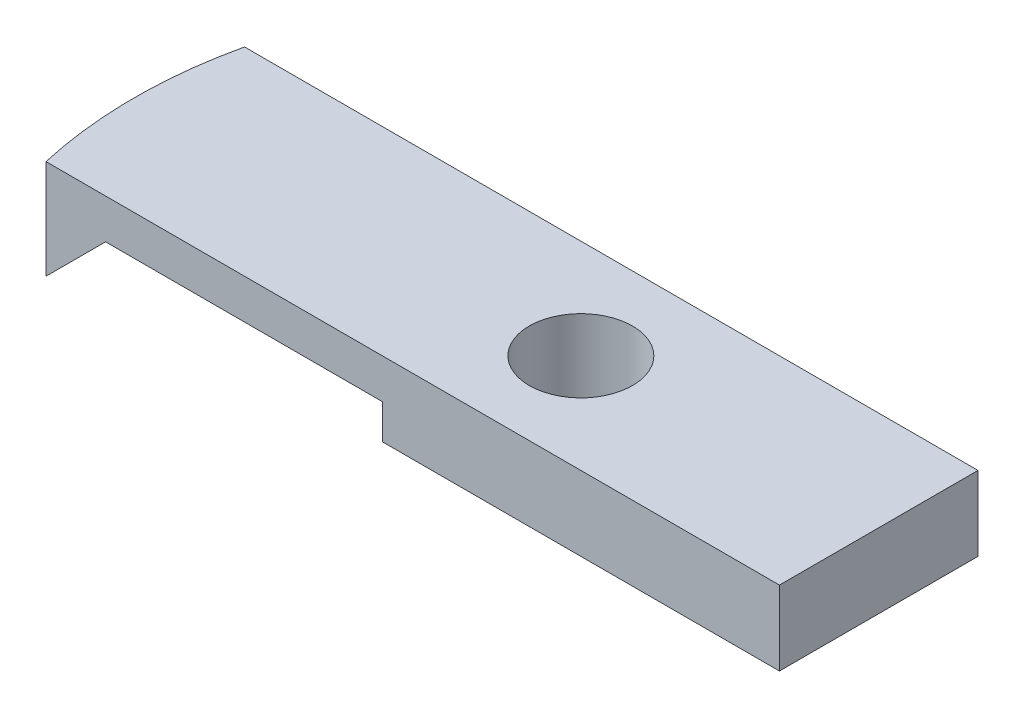
ISO-10303-21;
HEADER;
FILE_DESCRIPTION(('STEP AP214'),'2;1');
FILE_NAME('part.step','',(''),(''),'','','');
FILE_SCHEMA(('AUTOMOTIVE_DESIGN { 1 0 10303 214 1 1 1 1 }'));
ENDSEC;
DATA;
#1=APPLICATION_CONTEXT('core data for automotive mechanical design processes');
#2=APPLICATION_PROTOCOL_DEFINITION('international standard','automotive_design',2000,#1);
#3=PRODUCT_CONTEXT('',#1,'mechanical');
#4=PRODUCT('Part','Part','',(#3));
#5=PRODUCT_RELATED_PRODUCT_CATEGORY('part','',(#4));
#6=PRODUCT_DEFINITION_FORMATION('','',#4);
#7=PRODUCT_DEFINITION_CONTEXT('part definition',#1,'design');
#8=PRODUCT_DEFINITION('design','',#6,#7);
#9=PRODUCT_DEFINITION_SHAPE('','',#8);
#10=(LENGTH_UNIT() NAMED_UNIT(*) SI_UNIT(.MILLI.,.METRE.));
#11=(NAMED_UNIT(*) PLANE_ANGLE_UNIT() SI_UNIT($,.RADIAN.));
#12=(NAMED_UNIT(*) SI_UNIT($,.STERADIAN.) SOLID_ANGLE_UNIT());
#13=UNCERTAINTY_MEASURE_WITH_UNIT(LENGTH_MEASURE(1.E-05),#10,'distance_accuracy_value','');
#14=(GEOMETRIC_REPRESENTATION_CONTEXT(3) GLOBAL_UNCERTAINTY_ASSIGNED_CONTEXT((#13)) GLOBAL_UNIT_ASSIGNED_CONTEXT((#10,
#11,#12)) REPRESENTATION_CONTEXT('',''));
#15=CARTESIAN_POINT('',(0.,0.,0.));
#16=DIRECTION('',(0.,0.,1.));
#17=DIRECTION('',(1.,0.,0.));
#18=AXIS2_PLACEMENT_3D('',#15,#16,#17);
#19=CARTESIAN_POINT('',(0.,0.,0.));
#20=DIRECTION('',(0.,1.,0.));
#21=DIRECTION('',(0.,0.,1.));
#22=AXIS2_PLACEMENT_3D('',#19,#20,#21);
#23=PLANE('',#22);
#24=DIRECTION('',(0.,0.,1.));
#25=VECTOR('',#24,1.);
#26=CARTESIAN_POINT('',(-27.86051192997,0.,-6.35000000000001));
#27=LINE('',#26,#25);
#28=CARTESIAN_POINT('',(-27.86051192997,0.,-6.35000000000001));
#29=VERTEX_POINT('',#28);
#30=CARTESIAN_POINT('',(-27.86051192997,0.,6.35));
#31=VERTEX_POINT('',#30);
#32=EDGE_CURVE('E101',#29,#31,#27,.T.);
#33=ORIENTED_EDGE('',*,*,#32,.T.);
#34=CARTESIAN_POINT('',(0.,0.,0.));
#35=DIRECTION('',(0.,1.,0.));
#36=DIRECTION('',(0.,0.,1.));
#37=AXIS2_PLACEMENT_3D('',#34,#35,#36);
#38=CIRCLE('',#37,28.575);
#39=EDGE_CURVE('E124',#29,#31,#38,.T.);
#40=ORIENTED_EDGE('',*,*,#39,.F.);
#41=EDGE_LOOP('',(#33,#40));
#42=FACE_BOUND('',#41,.T.);
#43=ADVANCED_FACE('F39',(#42),#23,.F.);
#44=CARTESIAN_POINT('',(19.05,6.35,-6.35));
#45=DIRECTION('',(0.,0.,1.));
#46=DIRECTION('',(1.,0.,0.));
#47=AXIS2_PLACEMENT_3D('',#44,#45,#46);
#48=PLANE('',#47);
#49=DIRECTION('',(0.707106781186551,0.707106781186544,0.));
#50=VECTOR('',#49,1.);
#51=CARTESIAN_POINT('',(-13.9302559649848,13.930255964985,-6.35000000000001));
#52=LINE('',#51,#50);
#53=CARTESIAN_POINT('',(-24.05051192997,3.80999999999999,-6.35000000000001));
#54=VERTEX_POINT('',#53);
#55=EDGE_CURVE('E105',#29,#54,#52,.T.);
#56=ORIENTED_EDGE('',*,*,#55,.F.);
#57=DIRECTION('',(0.,-1.,0.));
#58=VECTOR('',#57,1.);
#59=CARTESIAN_POINT('',(-27.86051192997,6.35,-6.35000000000001));
#60=LINE('',#59,#58);
#61=CARTESIAN_POINT('',(-27.86051192997,6.35,-6.35000000000001));
#62=VERTEX_POINT('',#61);
#63=EDGE_CURVE('E11',#62,#29,#60,.T.);
#64=ORIENTED_EDGE('',*,*,#63,.F.);
#65=DIRECTION('',(-1.,0.,0.));
#66=VECTOR('',#65,1.);
#67=CARTESIAN_POINT('',(19.05,6.35,-6.35));
#68=LINE('',#67,#66);
#69=CARTESIAN_POINT('',(19.05,6.35,-6.35));
#70=VERTEX_POINT('',#69);
#71=EDGE_CURVE('E129',#70,#62,#68,.T.);
#72=ORIENTED_EDGE('',*,*,#71,.F.);
#73=DIRECTION('',(0.,-1.,0.));
#74=VECTOR('',#73,1.);
#75=CARTESIAN_POINT('',(19.05,6.35,-6.35));
#76=LINE('',#75,#74);
#77=CARTESIAN_POINT('',(19.05,1.58750000000001,-6.35));
#78=VERTEX_POINT('',#77);
#79=EDGE_CURVE('E148',#70,#78,#76,.T.);
#80=ORIENTED_EDGE('',*,*,#79,.T.);
#81=DIRECTION('',(-1.,0.,0.));
#82=VECTOR('',#81,1.);
#83=CARTESIAN_POINT('',(0.,1.58750000000001,-6.35000000000001));
#84=LINE('',#83,#82);
#85=CARTESIAN_POINT('',(-6.35,1.58750000000001,-6.35000000000001));
#86=VERTEX_POINT('',#85);
#87=EDGE_CURVE('E56',#78,#86,#84,.T.);
#88=ORIENTED_EDGE('',*,*,#87,.T.);
#89=DIRECTION('',(0.,-1.,0.));
#90=VECTOR('',#89,1.);
#91=CARTESIAN_POINT('',(-6.35,0.,-6.35000000000001));
#92=LINE('',#91,#90);
#93=CARTESIAN_POINT('',(-6.35,3.80999999999999,-6.35000000000001));
#94=VERTEX_POINT('',#93);
#95=EDGE_CURVE('E167',#94,#86,#92,.T.);
#96=ORIENTED_EDGE('',*,*,#95,.F.);
#97=DIRECTION('',(1.,0.,0.));
#98=VECTOR('',#97,1.);
#99=CARTESIAN_POINT('',(0.,3.80999999999999,-6.35000000000001));
#100=LINE('',#99,#98);
#101=EDGE_CURVE('E114',#54,#94,#100,.T.);
#102=ORIENTED_EDGE('',*,*,#101,.F.);
#103=EDGE_LOOP('',(#56,#64,#72,#80,#88,#96,#102));
#104=FACE_BOUND('',#103,.T.);
#105=ADVANCED_FACE('F41',(#104),#48,.F.);
#106=CARTESIAN_POINT('',(-27.86051192997,6.35,6.35));
#107=DIRECTION('',(0.,0.,-1.));
#108=DIRECTION('',(-1.,0.,0.));
#109=AXIS2_PLACEMENT_3D('',#106,#107,#108);
#110=PLANE('',#109);
#111=DIRECTION('',(0.707106781186551,0.707106781186544,0.));
#112=VECTOR('',#111,1.);
#113=CARTESIAN_POINT('',(-13.9302559649848,13.930255964985,6.35));
#114=LINE('',#113,#112);
#115=CARTESIAN_POINT('',(-24.05051192997,3.80999999999999,6.35));
#116=VERTEX_POINT('',#115);
#117=EDGE_CURVE('E108',#31,#116,#114,.T.);
#118=ORIENTED_EDGE('',*,*,#117,.T.);
#119=DIRECTION('',(1.,0.,0.));
#120=VECTOR('',#119,1.);
#121=CARTESIAN_POINT('',(0.,3.80999999999999,6.35));
#122=LINE('',#121,#120);
#123=CARTESIAN_POINT('',(-6.35,3.80999999999999,6.35));
#124=VERTEX_POINT('',#123);
#125=EDGE_CURVE('E122',#116,#124,#122,.T.);
#126=ORIENTED_EDGE('',*,*,#125,.T.);
#127=DIRECTION('',(0.,-1.,0.));
#128=VECTOR('',#127,1.);
#129=CARTESIAN_POINT('',(-6.35,0.,6.35));
#130=LINE('',#129,#128);
#131=CARTESIAN_POINT('',(-6.35,1.58750000000001,6.35));
#132=VERTEX_POINT('',#131);
#133=EDGE_CURVE('E179',#124,#132,#130,.T.);
#134=ORIENTED_EDGE('',*,*,#133,.T.);
#135=DIRECTION('',(-1.,0.,0.));
#136=VECTOR('',#135,1.);
#137=CARTESIAN_POINT('',(0.,1.58750000000001,6.35));
#138=LINE('',#137,#136);
#139=CARTESIAN_POINT('',(19.05,1.58750000000001,6.35));
#140=VERTEX_POINT('',#139);
#141=EDGE_CURVE('E164',#140,#132,#138,.T.);
#142=ORIENTED_EDGE('',*,*,#141,.F.);
#143=DIRECTION('',(0.,-1.,0.));
#144=VECTOR('',#143,1.);
#145=CARTESIAN_POINT('',(19.05,6.35,6.35));
#146=LINE('',#145,#144);
#147=CARTESIAN_POINT('',(19.05,6.35,6.35));
#148=VERTEX_POINT('',#147);
#149=EDGE_CURVE('E152',#148,#140,#146,.T.);
#150=ORIENTED_EDGE('',*,*,#149,.F.);
#151=DIRECTION('',(1.,0.,0.));
#152=VECTOR('',#151,1.);
#153=CARTESIAN_POINT('',(-27.86051192997,6.35,6.35));
#154=LINE('',#153,#152);
#155=CARTESIAN_POINT('',(-27.86051192997,6.35,6.35));
#156=VERTEX_POINT('',#155);
#157=EDGE_CURVE('E136',#156,#148,#154,.T.);
#158=ORIENTED_EDGE('',*,*,#157,.F.);
#159=DIRECTION('',(0.,-1.,0.));
#160=VECTOR('',#159,1.);
#161=CARTESIAN_POINT('',(-27.86051192997,6.35,6.35));
#162=LINE('',#161,#160);
#163=EDGE_CURVE('E49',#156,#31,#162,.T.);
#164=ORIENTED_EDGE('',*,*,#163,.T.);
#165=EDGE_LOOP('',(#118,#126,#134,#142,#150,#158,#164));
#166=FACE_BOUND('',#165,.T.);
#167=ADVANCED_FACE('F158',(#166),#110,.F.);
#168=CARTESIAN_POINT('',(0.,6.35,0.));
#169=DIRECTION('',(0.,1.,0.));
#170=DIRECTION('',(0.,0.,1.));
#171=AXIS2_PLACEMENT_3D('',#168,#169,#170);
#172=PLANE('',#171);
#173=ORIENTED_EDGE('',*,*,#71,.T.);
#174=CARTESIAN_POINT('',(0.,6.35,0.));
#175=DIRECTION('',(0.,1.,0.));
#176=DIRECTION('',(0.,0.,1.));
#177=AXIS2_PLACEMENT_3D('',#174,#175,#176);
#178=CIRCLE('',#177,28.575);
#179=EDGE_CURVE('E133',#62,#156,#178,.T.);
#180=ORIENTED_EDGE('',*,*,#179,.T.);
#181=ORIENTED_EDGE('',*,*,#157,.T.);
#182=DIRECTION('',(0.,0.,-1.));
#183=VECTOR('',#182,1.);
#184=CARTESIAN_POINT('',(19.05,6.35,-6.35));
#185=LINE('',#184,#183);
#186=EDGE_CURVE('E64',#148,#70,#185,.T.);
#187=ORIENTED_EDGE('',*,*,#186,.T.);
#188=EDGE_LOOP('',(#173,#180,#181,#187));
#189=FACE_BOUND('',#188,.T.);
#190=CARTESIAN_POINT('',(0.,6.35,0.));
#191=DIRECTION('',(0.,1.,0.));
#192=DIRECTION('',(0.,0.,1.));
#193=AXIS2_PLACEMENT_3D('',#190,#191,#192);
#194=CIRCLE('',#193,3.302);
#195=CARTESIAN_POINT('',(0.,6.35,3.302));
#196=VERTEX_POINT('',#195);
#197=EDGE_CURVE('E130',#196,#196,#194,.T.);
#198=ORIENTED_EDGE('',*,*,#197,.F.);
#199=EDGE_LOOP('',(#198));
#200=FACE_BOUND('',#199,.T.);
#201=ADVANCED_FACE('F138',(#189,#200),#172,.T.);
#202=CARTESIAN_POINT('',(0.,6.35,0.));
#203=DIRECTION('',(0.,-1.,0.));
#204=DIRECTION('',(0.,0.,-1.));
#205=AXIS2_PLACEMENT_3D('',#202,#203,#204);
#206=CYLINDRICAL_SURFACE('',#205,28.575);
#207=ORIENTED_EDGE('',*,*,#39,.T.);
#208=ORIENTED_EDGE('',*,*,#163,.F.);
#209=ORIENTED_EDGE('',*,*,#179,.F.);
#210=ORIENTED_EDGE('',*,*,#63,.T.);
#211=EDGE_LOOP('',(#207,#208,#209,#210));
#212=FACE_BOUND('',#211,.T.);
#213=ADVANCED_FACE('F132',(#212),#206,.T.);
#214=CARTESIAN_POINT('',(19.05,6.35,-6.35));
#215=DIRECTION('',(-1.,0.,0.));
#216=DIRECTION('',(0.,0.,1.));
#217=AXIS2_PLACEMENT_3D('',#214,#215,#216);
#218=PLANE('',#217);
#219=ORIENTED_EDGE('',*,*,#149,.T.);
#220=DIRECTION('',(0.,0.,1.));
#221=VECTOR('',#220,1.);
#222=CARTESIAN_POINT('',(19.05,1.58750000000001,-6.35000000000001));
#223=LINE('',#222,#221);
#224=EDGE_CURVE('E113',#78,#140,#223,.T.);
#225=ORIENTED_EDGE('',*,*,#224,.F.);
#226=ORIENTED_EDGE('',*,*,#79,.F.);
#227=ORIENTED_EDGE('',*,*,#186,.F.);
#228=EDGE_LOOP('',(#219,#225,#226,#227));
#229=FACE_BOUND('',#228,.T.);
#230=ADVANCED_FACE('F166',(#229),#218,.F.);
#231=CARTESIAN_POINT('',(0.,6.35,0.));
#232=DIRECTION('',(0.,-1.,0.));
#233=DIRECTION('',(0.,0.,-1.));
#234=AXIS2_PLACEMENT_3D('',#231,#232,#233);
#235=CYLINDRICAL_SURFACE('',#234,3.302);
#236=CARTESIAN_POINT('',(0.,1.58750000000001,0.));
#237=DIRECTION('',(0.,1.,0.));
#238=DIRECTION('',(-1.,0.,0.));
#239=AXIS2_PLACEMENT_3D('',#236,#237,#238);
#240=CIRCLE('',#239,3.302);
#241=CARTESIAN_POINT('',(-3.302,1.58750000000001,0.));
#242=VERTEX_POINT('',#241);
#243=EDGE_CURVE('E43',#242,#242,#240,.T.);
#244=ORIENTED_EDGE('',*,*,#243,.F.);
#245=EDGE_LOOP('',(#244));
#246=FACE_BOUND('',#245,.T.);
#247=ORIENTED_EDGE('',*,*,#197,.T.);
#248=EDGE_LOOP('',(#247));
#249=FACE_BOUND('',#248,.T.);
#250=ADVANCED_FACE('F208',(#246,#249),#235,.F.);
#251=CARTESIAN_POINT('',(-13.9302559649848,13.930255964985,-6.35000000000001));
#252=DIRECTION('',(0.707106781186544,-0.707106781186551,0.));
#253=DIRECTION('',(0.707106781186551,0.707106781186544,0.));
#254=AXIS2_PLACEMENT_3D('',#251,#252,#253);
#255=PLANE('',#254);
#256=ORIENTED_EDGE('',*,*,#117,.F.);
#257=ORIENTED_EDGE('',*,*,#32,.F.);
#258=ORIENTED_EDGE('',*,*,#55,.T.);
#259=DIRECTION('',(0.,0.,1.));
#260=VECTOR('',#259,1.);
#261=CARTESIAN_POINT('',(-24.05051192997,3.80999999999999,-6.35000000000001));
#262=LINE('',#261,#260);
#263=EDGE_CURVE('E184',#54,#116,#262,.T.);
#264=ORIENTED_EDGE('',*,*,#263,.T.);
#265=EDGE_LOOP('',(#256,#257,#258,#264));
#266=FACE_BOUND('',#265,.T.);
#267=ADVANCED_FACE('F103',(#266),#255,.T.);
#268=CARTESIAN_POINT('',(0.,3.80999999999999,-6.35000000000001));
#269=DIRECTION('',(0.,-1.,0.));
#270=DIRECTION('',(0.,0.,-1.));
#271=AXIS2_PLACEMENT_3D('',#268,#269,#270);
#272=PLANE('',#271);
#273=ORIENTED_EDGE('',*,*,#125,.F.);
#274=ORIENTED_EDGE('',*,*,#263,.F.);
#275=ORIENTED_EDGE('',*,*,#101,.T.);
#276=DIRECTION('',(0.,0.,1.));
#277=VECTOR('',#276,1.);
#278=CARTESIAN_POINT('',(-6.35,3.80999999999999,-6.35000000000001));
#279=LINE('',#278,#277);
#280=EDGE_CURVE('E187',#94,#124,#279,.T.);
#281=ORIENTED_EDGE('',*,*,#280,.T.);
#282=EDGE_LOOP('',(#273,#274,#275,#281));
#283=FACE_BOUND('',#282,.T.);
#284=ADVANCED_FACE('F200',(#283),#272,.T.);
#285=CARTESIAN_POINT('',(-6.35,0.,-6.35000000000001));
#286=DIRECTION('',(-1.,0.,0.));
#287=DIRECTION('',(0.,0.,1.));
#288=AXIS2_PLACEMENT_3D('',#285,#286,#287);
#289=PLANE('',#288);
#290=ORIENTED_EDGE('',*,*,#133,.F.);
#291=ORIENTED_EDGE('',*,*,#280,.F.);
#292=ORIENTED_EDGE('',*,*,#95,.T.);
#293=DIRECTION('',(0.,0.,1.));
#294=VECTOR('',#293,1.);
#295=CARTESIAN_POINT('',(-6.35,1.58750000000001,-6.35000000000001));
#296=LINE('',#295,#294);
#297=EDGE_CURVE('E190',#86,#132,#296,.T.);
#298=ORIENTED_EDGE('',*,*,#297,.T.);
#299=EDGE_LOOP('',(#290,#291,#292,#298));
#300=FACE_BOUND('',#299,.T.);
#301=ADVANCED_FACE('F198',(#300),#289,.T.);
#302=CARTESIAN_POINT('',(0.,1.58750000000001,-6.35000000000001));
#303=DIRECTION('',(0.,1.,0.));
#304=DIRECTION('',(-1.,0.,0.));
#305=AXIS2_PLACEMENT_3D('',#302,#303,#304);
#306=PLANE('',#305);
#307=ORIENTED_EDGE('',*,*,#243,.T.);
#308=EDGE_LOOP('',(#307));
#309=FACE_BOUND('',#308,.T.);
#310=ORIENTED_EDGE('',*,*,#141,.T.);
#311=ORIENTED_EDGE('',*,*,#297,.F.);
#312=ORIENTED_EDGE('',*,*,#87,.F.);
#313=ORIENTED_EDGE('',*,*,#224,.T.);
#314=EDGE_LOOP('',(#310,#311,#312,#313));
#315=FACE_BOUND('',#314,.T.);
#316=ADVANCED_FACE('F194',(#309,#315),#306,.F.);
#317=CLOSED_SHELL('',(#43,#105,#167,#201,#213,#230,#250,#267,#284,#301,#316));
#318=MANIFOLD_SOLID_BREP('B2',#317);
#319=ADVANCED_BREP_SHAPE_REPRESENTATION('',(#18,#318),#14);
#320=SHAPE_DEFINITION_REPRESENTATION(#9,#319);
ENDSEC;
END-ISO-10303-21;
